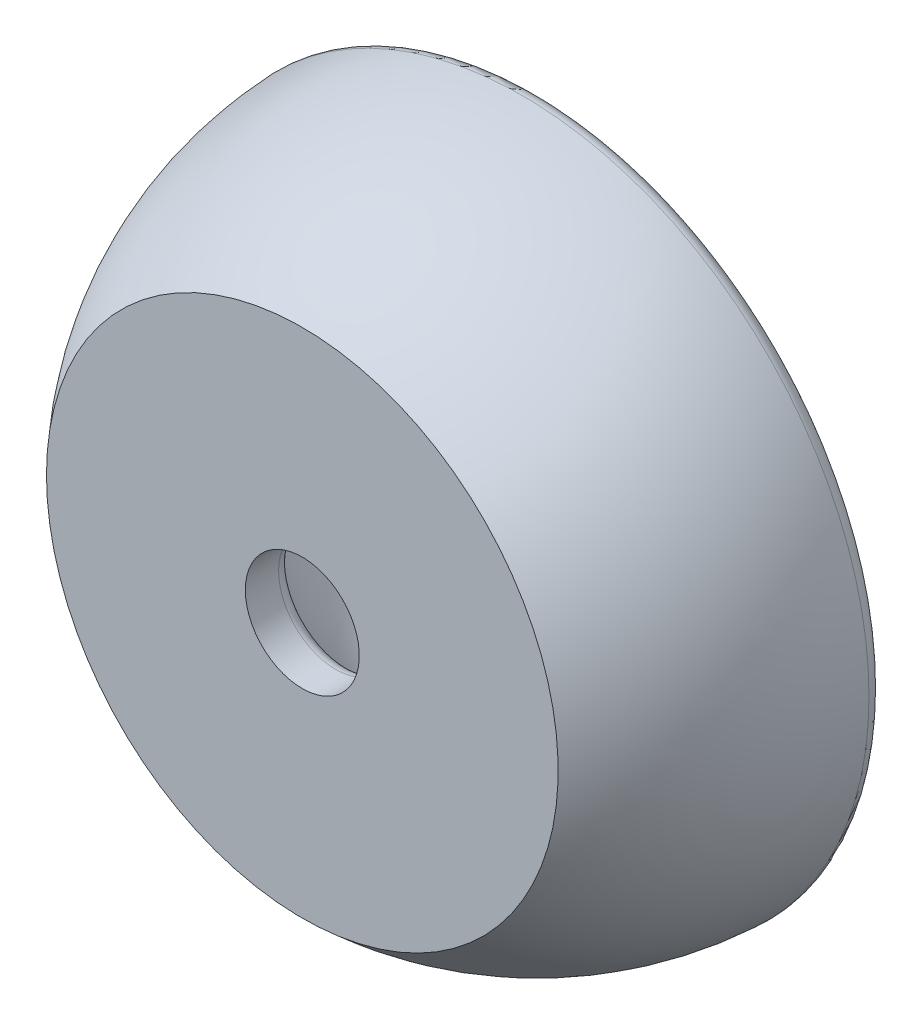
ISO-10303-21;
HEADER;
FILE_DESCRIPTION(('STEP AP214'),'2;1');
FILE_NAME('part.step','',(''),(''),'','','');
FILE_SCHEMA(('AUTOMOTIVE_DESIGN { 1 0 10303 214 1 1 1 1 }'));
ENDSEC;
DATA;
#1=APPLICATION_CONTEXT('core data for automotive mechanical design processes');
#2=APPLICATION_PROTOCOL_DEFINITION('international standard','automotive_design',2000,#1);
#3=PRODUCT_CONTEXT('',#1,'mechanical');
#4=PRODUCT('Part','Part','',(#3));
#5=PRODUCT_RELATED_PRODUCT_CATEGORY('part','',(#4));
#6=PRODUCT_DEFINITION_FORMATION('','',#4);
#7=PRODUCT_DEFINITION_CONTEXT('part definition',#1,'design');
#8=PRODUCT_DEFINITION('design','',#6,#7);
#9=PRODUCT_DEFINITION_SHAPE('','',#8);
#10=(LENGTH_UNIT() NAMED_UNIT(*) SI_UNIT(.MILLI.,.METRE.));
#11=(NAMED_UNIT(*) PLANE_ANGLE_UNIT() SI_UNIT($,.RADIAN.));
#12=(NAMED_UNIT(*) SI_UNIT($,.STERADIAN.) SOLID_ANGLE_UNIT());
#13=UNCERTAINTY_MEASURE_WITH_UNIT(LENGTH_MEASURE(1.E-05),#10,'distance_accuracy_value','');
#14=(GEOMETRIC_REPRESENTATION_CONTEXT(3) GLOBAL_UNCERTAINTY_ASSIGNED_CONTEXT((#13)) GLOBAL_UNIT_ASSIGNED_CONTEXT((#10,
#11,#12)) REPRESENTATION_CONTEXT('',''));
#15=CARTESIAN_POINT('',(0.,0.,0.));
#16=DIRECTION('',(0.,0.,1.));
#17=DIRECTION('',(1.,0.,0.));
#18=AXIS2_PLACEMENT_3D('',#15,#16,#17);
#19=CARTESIAN_POINT('',(0.,0.,0.));
#20=DIRECTION('',(0.,0.,-1.));
#21=DIRECTION('',(1.,0.,0.));
#22=AXIS2_PLACEMENT_3D('',#19,#20,#21);
#23=SPHERICAL_SURFACE('',#22,5.6);
#24=CARTESIAN_POINT('',(0.,0.,5.27973063285955));
#25=DIRECTION('',(0.,0.,-1.));
#26=DIRECTION('',(-1.,0.,0.));
#27=AXIS2_PLACEMENT_3D('',#24,#25,#26);
#28=CIRCLE('',#27,1.86666666666667);
#29=CARTESIAN_POINT('',(-1.86666666666667,0.,5.27973063285955));
#30=VERTEX_POINT('',#29);
#31=EDGE_CURVE('E10',#30,#30,#28,.F.);
#32=ORIENTED_EDGE('',*,*,#31,.T.);
#33=EDGE_LOOP('',(#32));
#34=FACE_BOUND('',#33,.T.);
#35=CARTESIAN_POINT('',(0.,0.,0.373333333333333));
#36=DIRECTION('',(0.,0.,-1.));
#37=DIRECTION('',(-1.,0.,0.));
#38=AXIS2_PLACEMENT_3D('',#35,#36,#37);
#39=CIRCLE('',#38,5.58754169758242);
#40=CARTESIAN_POINT('',(-5.58754169758242,0.,0.373333333333333));
#41=VERTEX_POINT('',#40);
#42=EDGE_CURVE('E41',#41,#41,#39,.T.);
#43=ORIENTED_EDGE('',*,*,#42,.T.);
#44=EDGE_LOOP('',(#43));
#45=FACE_BOUND('',#44,.T.);
#46=ADVANCED_FACE('F30',(#34,#45),#23,.F.);
#47=CARTESIAN_POINT('',(0.,0.,0.));
#48=DIRECTION('',(0.,0.,-1.));
#49=DIRECTION('',(-1.,0.,0.));
#50=AXIS2_PLACEMENT_3D('',#47,#48,#49);
#51=CYLINDRICAL_SURFACE('',#50,1.6);
#52=CARTESIAN_POINT('',(0.,0.,5.65685424949238));
#53=DIRECTION('',(0.,0.,-1.));
#54=DIRECTION('',(-1.,0.,0.));
#55=AXIS2_PLACEMENT_3D('',#52,#53,#54);
#56=CIRCLE('',#55,1.6);
#57=CARTESIAN_POINT('',(-1.6,0.,5.65685424949238));
#58=VERTEX_POINT('',#57);
#59=EDGE_CURVE('E37',#58,#58,#56,.T.);
#60=ORIENTED_EDGE('',*,*,#59,.T.);
#61=EDGE_LOOP('',(#60));
#62=FACE_BOUND('',#61,.T.);
#63=CARTESIAN_POINT('',(0.,0.,6.59061276107574));
#64=DIRECTION('',(0.,0.,-1.));
#65=DIRECTION('',(-1.,0.,0.));
#66=AXIS2_PLACEMENT_3D('',#63,#64,#65);
#67=CIRCLE('',#66,1.6);
#68=CARTESIAN_POINT('',(-1.6,0.,6.59061276107574));
#69=VERTEX_POINT('',#68);
#70=EDGE_CURVE('E56',#69,#69,#67,.T.);
#71=ORIENTED_EDGE('',*,*,#70,.F.);
#72=EDGE_LOOP('',(#71));
#73=FACE_BOUND('',#72,.T.);
#74=ADVANCED_FACE('F68',(#62,#73),#51,.F.);
#75=CARTESIAN_POINT('',(1.6,0.,6.59061276107574));
#76=DIRECTION('',(0.,0.,-1.));
#77=DIRECTION('',(-1.,0.,0.));
#78=AXIS2_PLACEMENT_3D('',#75,#76,#77);
#79=PLANE('',#78);
#80=CARTESIAN_POINT('',(0.,0.,6.59061276107574));
#81=DIRECTION('',(0.,0.,-1.));
#82=DIRECTION('',(-1.,0.,0.));
#83=AXIS2_PLACEMENT_3D('',#80,#81,#82);
#84=CIRCLE('',#83,7.18514602729447);
#85=CARTESIAN_POINT('',(-7.18514602729447,0.,6.59061276107574));
#86=VERTEX_POINT('',#85);
#87=EDGE_CURVE('E59',#86,#86,#84,.T.);
#88=ORIENTED_EDGE('',*,*,#87,.F.);
#89=EDGE_LOOP('',(#88));
#90=FACE_BOUND('',#89,.T.);
#91=ORIENTED_EDGE('',*,*,#70,.T.);
#92=EDGE_LOOP('',(#91));
#93=FACE_BOUND('',#92,.T.);
#94=ADVANCED_FACE('F65',(#90,#93),#79,.F.);
#95=CARTESIAN_POINT('',(0.,0.,0.));
#96=DIRECTION('',(0.,0.,-1.));
#97=DIRECTION('',(1.,0.,0.));
#98=AXIS2_PLACEMENT_3D('',#95,#96,#97);
#99=SPHERICAL_SURFACE('',#98,9.75);
#100=CARTESIAN_POINT('',(0.,0.,0.417112299465241));
#101=DIRECTION('',(0.,0.,-1.));
#102=DIRECTION('',(-1.,0.,0.));
#103=AXIS2_PLACEMENT_3D('',#100,#101,#102);
#104=CIRCLE('',#103,9.74107372570575);
#105=CARTESIAN_POINT('',(-9.74107372570575,0.,0.417112299465241));
#106=VERTEX_POINT('',#105);
#107=EDGE_CURVE('E45',#106,#106,#104,.F.);
#108=ORIENTED_EDGE('',*,*,#107,.T.);
#109=EDGE_LOOP('',(#108));
#110=FACE_BOUND('',#109,.T.);
#111=ORIENTED_EDGE('',*,*,#87,.T.);
#112=EDGE_LOOP('',(#111));
#113=FACE_BOUND('',#112,.T.);
#114=ADVANCED_FACE('F63',(#110,#113),#99,.T.);
#115=CARTESIAN_POINT('',(5.6,0.,0.));
#116=DIRECTION('',(0.,0.,1.));
#117=DIRECTION('',(1.,0.,0.));
#118=AXIS2_PLACEMENT_3D('',#115,#116,#117);
#119=PLANE('',#118);
#120=CARTESIAN_POINT('',(0.,0.,0.));
#121=DIRECTION('',(0.,0.,1.));
#122=DIRECTION('',(1.,0.,0.));
#123=AXIS2_PLACEMENT_3D('',#120,#121,#122);
#124=CIRCLE('',#123,9.34143993183064);
#125=CARTESIAN_POINT('',(9.34143993183064,0.,0.));
#126=VERTEX_POINT('',#125);
#127=EDGE_CURVE('E50',#126,#126,#124,.F.);
#128=ORIENTED_EDGE('',*,*,#127,.T.);
#129=EDGE_LOOP('',(#128));
#130=FACE_BOUND('',#129,.T.);
#131=CARTESIAN_POINT('',(0.,0.,0.));
#132=DIRECTION('',(0.,0.,1.));
#133=DIRECTION('',(1.,0.,0.));
#134=AXIS2_PLACEMENT_3D('',#131,#132,#133);
#135=CIRCLE('',#134,5.98665181883831);
#136=CARTESIAN_POINT('',(5.98665181883831,0.,0.));
#137=VERTEX_POINT('',#136);
#138=EDGE_CURVE('E53',#137,#137,#135,.T.);
#139=ORIENTED_EDGE('',*,*,#138,.T.);
#140=EDGE_LOOP('',(#139));
#141=FACE_BOUND('',#140,.T.);
#142=ADVANCED_FACE('F83',(#130,#141),#119,.F.);
#143=CARTESIAN_POINT('',(0.,0.,0.4));
#144=DIRECTION('',(0.,0.,1.));
#145=DIRECTION('',(1.,0.,0.));
#146=AXIS2_PLACEMENT_3D('',#143,#144,#145);
#147=TOROIDAL_SURFACE('',#146,9.34143993183064,0.4);
#148=ORIENTED_EDGE('',*,*,#107,.F.);
#149=EDGE_LOOP('',(#148));
#150=FACE_BOUND('',#149,.T.);
#151=ORIENTED_EDGE('',*,*,#127,.F.);
#152=EDGE_LOOP('',(#151));
#153=FACE_BOUND('',#152,.T.);
#154=ADVANCED_FACE('F80',(#150,#153),#147,.T.);
#155=CARTESIAN_POINT('',(0.,0.,0.4));
#156=DIRECTION('',(0.,0.,1.));
#157=DIRECTION('',(1.,0.,0.));
#158=AXIS2_PLACEMENT_3D('',#155,#156,#157);
#159=TOROIDAL_SURFACE('',#158,5.98665181883831,0.4);
#160=ORIENTED_EDGE('',*,*,#138,.F.);
#161=EDGE_LOOP('',(#160));
#162=FACE_BOUND('',#161,.T.);
#163=ORIENTED_EDGE('',*,*,#42,.F.);
#164=EDGE_LOOP('',(#163));
#165=FACE_BOUND('',#164,.T.);
#166=ADVANCED_FACE('F82',(#162,#165),#159,.T.);
#167=CARTESIAN_POINT('',(0.,0.,5.65685424949238));
#168=DIRECTION('',(0.,0.,-1.));
#169=DIRECTION('',(-1.,0.,0.));
#170=AXIS2_PLACEMENT_3D('',#167,#168,#169);
#171=TOROIDAL_SURFACE('',#170,2.,0.4);
#172=ORIENTED_EDGE('',*,*,#31,.F.);
#173=EDGE_LOOP('',(#172));
#174=FACE_BOUND('',#173,.T.);
#175=ORIENTED_EDGE('',*,*,#59,.F.);
#176=EDGE_LOOP('',(#175));
#177=FACE_BOUND('',#176,.T.);
#178=ADVANCED_FACE('F32',(#174,#177),#171,.T.);
#179=CLOSED_SHELL('',(#46,#74,#94,#114,#142,#154,#166,#178));
#180=MANIFOLD_SOLID_BREP('B2',#179);
#181=ADVANCED_BREP_SHAPE_REPRESENTATION('',(#18,#180),#14);
#182=SHAPE_DEFINITION_REPRESENTATION(#9,#181);
ENDSEC;
END-ISO-10303-21;
